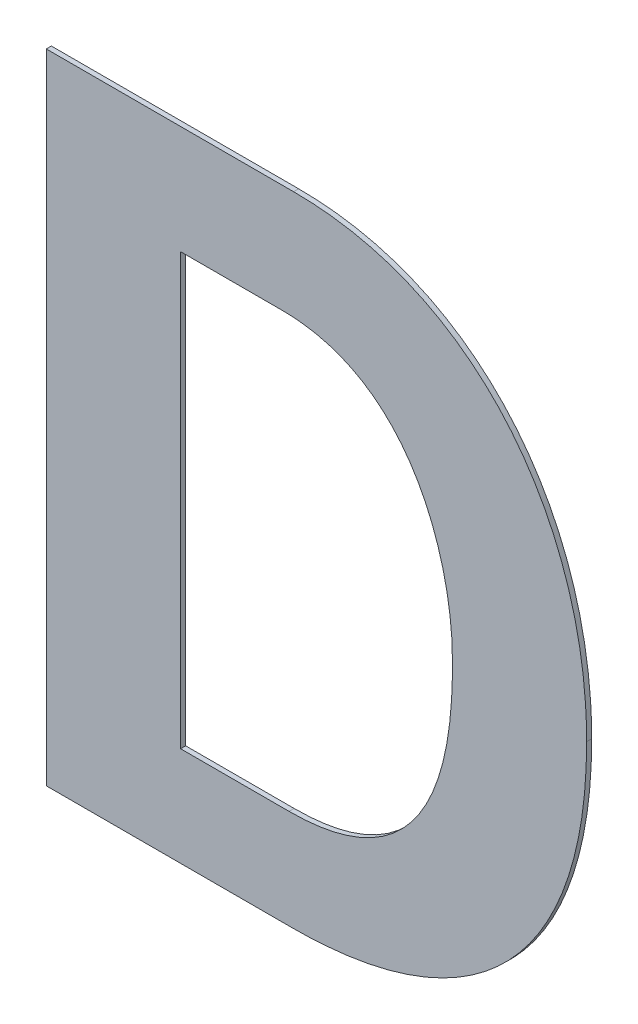
ISO-10303-21;
HEADER;
FILE_DESCRIPTION(('STEP AP214'),'2;1');
FILE_NAME('part.step','',(''),(''),'','','');
FILE_SCHEMA(('AUTOMOTIVE_DESIGN { 1 0 10303 214 1 1 1 1 }'));
ENDSEC;
DATA;
#1=APPLICATION_CONTEXT('core data for automotive mechanical design processes');
#2=APPLICATION_PROTOCOL_DEFINITION('international standard','automotive_design',2000,#1);
#3=PRODUCT_CONTEXT('',#1,'mechanical');
#4=PRODUCT('Part','Part','',(#3));
#5=PRODUCT_RELATED_PRODUCT_CATEGORY('part','',(#4));
#6=PRODUCT_DEFINITION_FORMATION('','',#4);
#7=PRODUCT_DEFINITION_CONTEXT('part definition',#1,'design');
#8=PRODUCT_DEFINITION('design','',#6,#7);
#9=PRODUCT_DEFINITION_SHAPE('','',#8);
#10=(LENGTH_UNIT() NAMED_UNIT(*) SI_UNIT(.MILLI.,.METRE.));
#11=(NAMED_UNIT(*) PLANE_ANGLE_UNIT() SI_UNIT($,.RADIAN.));
#12=(NAMED_UNIT(*) SI_UNIT($,.STERADIAN.) SOLID_ANGLE_UNIT());
#13=UNCERTAINTY_MEASURE_WITH_UNIT(LENGTH_MEASURE(1.E-05),#10,'distance_accuracy_value','');
#14=(GEOMETRIC_REPRESENTATION_CONTEXT(3) GLOBAL_UNCERTAINTY_ASSIGNED_CONTEXT((#13)) GLOBAL_UNIT_ASSIGNED_CONTEXT((#10,
#11,#12)) REPRESENTATION_CONTEXT('',''));
#15=CARTESIAN_POINT('',(0.,0.,0.));
#16=DIRECTION('',(0.,0.,1.));
#17=DIRECTION('',(1.,0.,0.));
#18=AXIS2_PLACEMENT_3D('',#15,#16,#17);
#19=CARTESIAN_POINT('',(-0.8101308747903,-0.1544312260326,0.00086146168299));
#20=DIRECTION('',(0.,-1.,0.));
#21=DIRECTION('',(0.,0.,-1.));
#22=AXIS2_PLACEMENT_3D('',#19,#20,#21);
#23=PLANE('',#22);
#24=DIRECTION('',(0.,0.,1.));
#25=VECTOR('',#24,1.);
#26=CARTESIAN_POINT('',(-0.7809968723185,-0.1544312260326,-0.00033853831701));
#27=LINE('',#26,#25);
#28=CARTESIAN_POINT('',(-0.7809968723185,-0.1544312260326,-0.00033853831701));
#29=VERTEX_POINT('',#28);
#30=CARTESIAN_POINT('',(-0.7809968723185,-0.1544312260326,0.00086146168299));
#31=VERTEX_POINT('',#30);
#32=EDGE_CURVE('E11',#29,#31,#27,.T.);
#33=ORIENTED_EDGE('',*,*,#32,.T.);
#34=DIRECTION('',(-1.,0.,0.));
#35=VECTOR('',#34,1.);
#36=CARTESIAN_POINT('',(-0.7809968723185,-0.1544312260326,0.00086146168299));
#37=LINE('',#36,#35);
#38=CARTESIAN_POINT('',(-0.8392648772621,-0.1544312260326,0.00086146168299));
#39=VERTEX_POINT('',#38);
#40=EDGE_CURVE('E24',#31,#39,#37,.T.);
#41=ORIENTED_EDGE('',*,*,#40,.T.);
#42=DIRECTION('',(0.,0.,1.));
#43=VECTOR('',#42,1.);
#44=CARTESIAN_POINT('',(-0.8392648772621,-0.1544312260326,-0.00033853831701));
#45=LINE('',#44,#43);
#46=CARTESIAN_POINT('',(-0.8392648772621,-0.1544312260326,-0.00033853831701));
#47=VERTEX_POINT('',#46);
#48=EDGE_CURVE('E212',#47,#39,#45,.T.);
#49=ORIENTED_EDGE('',*,*,#48,.F.);
#50=DIRECTION('',(-1.,0.,0.));
#51=VECTOR('',#50,1.);
#52=CARTESIAN_POINT('',(-0.7809968723185,-0.1544312260326,-0.00033853831701));
#53=LINE('',#52,#51);
#54=EDGE_CURVE('E209',#29,#47,#53,.T.);
#55=ORIENTED_EDGE('',*,*,#54,.F.);
#56=EDGE_LOOP('',(#33,#41,#49,#55));
#57=FACE_BOUND('',#56,.T.);
#58=ADVANCED_FACE('F17',(#57),#23,.T.);
#59=CARTESIAN_POINT('',(-0.8392648772621,-0.078781583834882,0.00086146168299));
#60=DIRECTION('',(-1.,0.,0.));
#61=DIRECTION('',(0.,0.,1.));
#62=AXIS2_PLACEMENT_3D('',#59,#60,#61);
#63=PLANE('',#62);
#64=ORIENTED_EDGE('',*,*,#48,.T.);
#65=DIRECTION('',(0.,1.,0.));
#66=VECTOR('',#65,1.);
#67=CARTESIAN_POINT('',(-0.8392648772621,-0.1544312260326,0.00086146168299));
#68=LINE('',#67,#66);
#69=CARTESIAN_POINT('',(-0.8392648772621,-0.00313194163716401,0.00086146168299));
#70=VERTEX_POINT('',#69);
#71=EDGE_CURVE('E207',#39,#70,#68,.T.);
#72=ORIENTED_EDGE('',*,*,#71,.T.);
#73=DIRECTION('',(0.,0.,1.));
#74=VECTOR('',#73,1.);
#75=CARTESIAN_POINT('',(-0.8392648772621,-0.00313194163716401,-0.00033853831701));
#76=LINE('',#75,#74);
#77=CARTESIAN_POINT('',(-0.8392648772621,-0.00313194163716401,-0.00033853831701));
#78=VERTEX_POINT('',#77);
#79=EDGE_CURVE('E204',#78,#70,#76,.T.);
#80=ORIENTED_EDGE('',*,*,#79,.F.);
#81=DIRECTION('',(0.,1.,0.));
#82=VECTOR('',#81,1.);
#83=CARTESIAN_POINT('',(-0.8392648772621,-0.1544312260326,-0.00033853831701));
#84=LINE('',#83,#82);
#85=EDGE_CURVE('E201',#47,#78,#84,.T.);
#86=ORIENTED_EDGE('',*,*,#85,.F.);
#87=EDGE_LOOP('',(#64,#72,#80,#86));
#88=FACE_BOUND('',#87,.T.);
#89=ADVANCED_FACE('F219',(#88),#63,.T.);
#90=CARTESIAN_POINT('',(-0.8099545875059,-0.00313194163716401,0.00086146168299));
#91=DIRECTION('',(0.,1.,0.));
#92=DIRECTION('',(0.,0.,1.));
#93=AXIS2_PLACEMENT_3D('',#90,#91,#92);
#94=PLANE('',#93);
#95=ORIENTED_EDGE('',*,*,#79,.T.);
#96=DIRECTION('',(1.,0.,0.));
#97=VECTOR('',#96,1.);
#98=CARTESIAN_POINT('',(-0.8392648772621,-0.00313194163716401,0.00086146168299));
#99=LINE('',#98,#97);
#100=CARTESIAN_POINT('',(-0.7806442977497,-0.00313194163716401,0.00086146168299));
#101=VERTEX_POINT('',#100);
#102=EDGE_CURVE('E199',#70,#101,#99,.T.);
#103=ORIENTED_EDGE('',*,*,#102,.T.);
#104=DIRECTION('',(0.,0.,1.));
#105=VECTOR('',#104,1.);
#106=CARTESIAN_POINT('',(-0.7806442977497,-0.00313194163716401,-0.00033853831701));
#107=LINE('',#106,#105);
#108=CARTESIAN_POINT('',(-0.7806442977497,-0.00313194163716401,-0.00033853831701));
#109=VERTEX_POINT('',#108);
#110=EDGE_CURVE('E196',#109,#101,#107,.T.);
#111=ORIENTED_EDGE('',*,*,#110,.F.);
#112=DIRECTION('',(1.,0.,0.));
#113=VECTOR('',#112,1.);
#114=CARTESIAN_POINT('',(-0.8392648772621,-0.00313194163716401,-0.00033853831701));
#115=LINE('',#114,#113);
#116=EDGE_CURVE('E190',#78,#109,#115,.T.);
#117=ORIENTED_EDGE('',*,*,#116,.F.);
#118=EDGE_LOOP('',(#95,#103,#111,#117));
#119=FACE_BOUND('',#118,.T.);
#120=ADVANCED_FACE('F225',(#119),#94,.T.);
#121=CARTESIAN_POINT('',(-0.7806442977497,-0.00313194163716401,0.00086146168299));
#122=CARTESIAN_POINT('',(-0.7806442977497,-0.00313194163716401,-0.00057853831701));
#123=CARTESIAN_POINT('',(-0.7372075443469,-0.00313194163716401,0.00086146168299));
#124=CARTESIAN_POINT('',(-0.7372075443469,-0.00313194163716401,-0.00057853831701));
#125=CARTESIAN_POINT('',(-0.7111531506869,-0.0375122970442,0.00086146168299));
#126=CARTESIAN_POINT('',(-0.7111531506869,-0.0375122970442,-0.00057853831701));
#127=CARTESIAN_POINT('',(-0.7111531506869,-0.0813016250162,0.00086146168299));
#128=CARTESIAN_POINT('',(-0.7111531506869,-0.0813016250162,-0.00057853831701));
#129=B_SPLINE_SURFACE_WITH_KNOTS('',3,1,((#121,#122),(#123,#124),(#125,#126),(#127,#128)),
.UNSPECIFIED.,.F.,.F.,.F.,(4,4),(2,2),(0.,1.),(0.,0.00036),.UNSPECIFIED.);
#130=CARTESIAN_POINT('',(-0.7806442977497,-0.00313194163716401,0.00086146168299));
#131=CARTESIAN_POINT('',(-0.7372075443469,-0.00313194163716401,0.00086146168299));
#132=CARTESIAN_POINT('',(-0.7111531506869,-0.0375122970442,0.00086146168299));
#133=CARTESIAN_POINT('',(-0.7111531506869,-0.0813016250162,0.00086146168299));
#134=B_SPLINE_CURVE_WITH_KNOTS('',3,(#130,#131,#132,#133),.UNSPECIFIED.,.F.,.F.,(4,4),(0.,1.),.UNSPECIFIED.);
#135=CARTESIAN_POINT('',(-0.7111531506869,-0.0813016250162,0.00086146168299));
#136=VERTEX_POINT('',#135);
#137=EDGE_CURVE('E186',#101,#136,#134,.T.);
#138=DIRECTION('',(0.,0.,1.));
#139=VECTOR('',#138,1.);
#140=CARTESIAN_POINT('',(-0.7111531506869,-0.0813016250162,-0.00033853831701));
#141=LINE('',#140,#139);
#142=CARTESIAN_POINT('',(-0.7111531506869,-0.0813016250162,-0.00033853831701));
#143=VERTEX_POINT('',#142);
#144=EDGE_CURVE('E180',#143,#136,#141,.T.);
#145=CARTESIAN_POINT('',(-0.7806442977497,-0.00313194163716401,-0.00033853831701));
#146=CARTESIAN_POINT('',(-0.7372075443469,-0.00313194163716401,-0.00033853831701));
#147=CARTESIAN_POINT('',(-0.7111531506869,-0.0375122970442,-0.00033853831701));
#148=CARTESIAN_POINT('',(-0.7111531506869,-0.0813016250162,-0.00033853831701));
#149=B_SPLINE_CURVE_WITH_KNOTS('',3,(#145,#146,#147,#148),.UNSPECIFIED.,.F.,.F.,(4,4),(0.,1.),.UNSPECIFIED.);
#150=EDGE_CURVE('E172',#109,#143,#149,.T.);
#151=ORIENTED_EDGE('',*,*,#110,.T.);
#152=ORIENTED_EDGE('',*,*,#137,.T.);
#153=ORIENTED_EDGE('',*,*,#144,.F.);
#154=ORIENTED_EDGE('',*,*,#150,.F.);
#155=EDGE_LOOP('',(#151,#152,#153,#154));
#156=FACE_BOUND('',#155,.T.);
#157=ADVANCED_FACE('F229',(#156),#129,.T.);
#158=CARTESIAN_POINT('',(-0.7111531506869,-0.0813016250162,0.00086146168299));
#159=CARTESIAN_POINT('',(-0.7111531506869,-0.0813016250162,-0.00057853831701));
#160=CARTESIAN_POINT('',(-0.7111531506869,-0.1251054027658,0.00086146168299));
#161=CARTESIAN_POINT('',(-0.7111531506869,-0.1251054027658,-0.00057853831701));
#162=CARTESIAN_POINT('',(-0.7343060290417,-0.1544312260326,0.00086146168299));
#163=CARTESIAN_POINT('',(-0.7343060290417,-0.1544312260326,-0.00057853831701));
#164=CARTESIAN_POINT('',(-0.7809968723185,-0.1544312260326,0.00086146168299));
#165=CARTESIAN_POINT('',(-0.7809968723185,-0.1544312260326,-0.00057853831701));
#166=B_SPLINE_SURFACE_WITH_KNOTS('',3,1,((#158,#159),(#160,#161),(#162,#163),(#164,#165)),
.UNSPECIFIED.,.F.,.F.,.F.,(4,4),(2,2),(0.,1.),(0.,0.00036),.UNSPECIFIED.);
#167=CARTESIAN_POINT('',(-0.7111531506869,-0.0813016250162,0.00086146168299));
#168=CARTESIAN_POINT('',(-0.7111531506869,-0.1251054027658,0.00086146168299));
#169=CARTESIAN_POINT('',(-0.7343060290417,-0.1544312260326,0.00086146168299));
#170=CARTESIAN_POINT('',(-0.7809968723185,-0.1544312260326,0.00086146168299));
#171=B_SPLINE_CURVE_WITH_KNOTS('',3,(#167,#168,#169,#170),.UNSPECIFIED.,.F.,.F.,(4,4),(0.,1.),.UNSPECIFIED.);
#172=EDGE_CURVE('E165',#136,#31,#171,.T.);
#173=CARTESIAN_POINT('',(-0.7111531506869,-0.0813016250162,-0.00033853831701));
#174=CARTESIAN_POINT('',(-0.7111531506869,-0.1251054027658,-0.00033853831701));
#175=CARTESIAN_POINT('',(-0.7343060290417,-0.1544312260326,-0.00033853831701));
#176=CARTESIAN_POINT('',(-0.7809968723185,-0.1544312260326,-0.00033853831701));
#177=B_SPLINE_CURVE_WITH_KNOTS('',3,(#173,#174,#175,#176),.UNSPECIFIED.,.F.,.F.,(4,4),(0.,1.),.UNSPECIFIED.);
#178=EDGE_CURVE('E160',#143,#29,#177,.T.);
#179=ORIENTED_EDGE('',*,*,#144,.T.);
#180=ORIENTED_EDGE('',*,*,#172,.T.);
#181=ORIENTED_EDGE('',*,*,#32,.F.);
#182=ORIENTED_EDGE('',*,*,#178,.F.);
#183=EDGE_LOOP('',(#179,#180,#181,#182));
#184=FACE_BOUND('',#183,.T.);
#185=ADVANCED_FACE('F231',(#184),#166,.T.);
#186=CARTESIAN_POINT('',(-0.7954766330235,-0.028836650683436,0.00086146168299));
#187=DIRECTION('',(0.,-1.,0.));
#188=DIRECTION('',(0.,0.,-1.));
#189=AXIS2_PLACEMENT_3D('',#186,#187,#188);
#190=PLANE('',#189);
#191=DIRECTION('',(0.,0.,1.));
#192=VECTOR('',#191,1.);
#193=CARTESIAN_POINT('',(-0.7835313632777,-0.028836650683436,-0.00033853831701));
#194=LINE('',#193,#192);
#195=CARTESIAN_POINT('',(-0.7835313632777,-0.028836650683436,-0.00033853831701));
#196=VERTEX_POINT('',#195);
#197=CARTESIAN_POINT('',(-0.7835313632777,-0.028836650683436,0.00086146168299));
#198=VERTEX_POINT('',#197);
#199=EDGE_CURVE('E114',#196,#198,#194,.T.);
#200=ORIENTED_EDGE('',*,*,#199,.T.);
#201=DIRECTION('',(-1.,0.,0.));
#202=VECTOR('',#201,1.);
#203=CARTESIAN_POINT('',(-0.7835313632777,-0.028836650683436,0.00086146168299));
#204=LINE('',#203,#202);
#205=CARTESIAN_POINT('',(-0.8074219027693,-0.028836650683436,0.00086146168299));
#206=VERTEX_POINT('',#205);
#207=EDGE_CURVE('E157',#198,#206,#204,.T.);
#208=ORIENTED_EDGE('',*,*,#207,.T.);
#209=DIRECTION('',(0.,0.,1.));
#210=VECTOR('',#209,1.);
#211=CARTESIAN_POINT('',(-0.8074219027693,-0.028836650683436,-0.00033853831701));
#212=LINE('',#211,#210);
#213=CARTESIAN_POINT('',(-0.8074219027693,-0.028836650683436,-0.00033853831701));
#214=VERTEX_POINT('',#213);
#215=EDGE_CURVE('E154',#214,#206,#212,.T.);
#216=ORIENTED_EDGE('',*,*,#215,.F.);
#217=DIRECTION('',(-1.,0.,0.));
#218=VECTOR('',#217,1.);
#219=CARTESIAN_POINT('',(-0.7835313632777,-0.028836650683436,-0.00033853831701));
#220=LINE('',#219,#218);
#221=EDGE_CURVE('E152',#196,#214,#220,.T.);
#222=ORIENTED_EDGE('',*,*,#221,.F.);
#223=EDGE_LOOP('',(#200,#208,#216,#222));
#224=FACE_BOUND('',#223,.T.);
#225=ADVANCED_FACE('F233',(#224),#190,.T.);
#226=CARTESIAN_POINT('',(-0.8074219027693,-0.079865317141018,0.00086146168299));
#227=DIRECTION('',(1.,0.,0.));
#228=DIRECTION('',(0.,0.,-1.));
#229=AXIS2_PLACEMENT_3D('',#226,#227,#228);
#230=PLANE('',#229);
#231=ORIENTED_EDGE('',*,*,#215,.T.);
#232=DIRECTION('',(0.,-1.,0.));
#233=VECTOR('',#232,1.);
#234=CARTESIAN_POINT('',(-0.8074219027693,-0.028836650683436,0.00086146168299));
#235=LINE('',#234,#233);
#236=CARTESIAN_POINT('',(-0.8074219027693,-0.1308939835986,0.00086146168299));
#237=VERTEX_POINT('',#236);
#238=EDGE_CURVE('E150',#206,#237,#235,.T.);
#239=ORIENTED_EDGE('',*,*,#238,.T.);
#240=DIRECTION('',(0.,0.,1.));
#241=VECTOR('',#240,1.);
#242=CARTESIAN_POINT('',(-0.8074219027693,-0.1308939835986,-0.00033853831701));
#243=LINE('',#242,#241);
#244=CARTESIAN_POINT('',(-0.8074219027693,-0.1308939835986,-0.00033853831701));
#245=VERTEX_POINT('',#244);
#246=EDGE_CURVE('E147',#245,#237,#243,.T.);
#247=ORIENTED_EDGE('',*,*,#246,.F.);
#248=DIRECTION('',(0.,-1.,0.));
#249=VECTOR('',#248,1.);
#250=CARTESIAN_POINT('',(-0.8074219027693,-0.028836650683436,-0.00033853831701));
#251=LINE('',#250,#249);
#252=EDGE_CURVE('E145',#214,#245,#251,.T.);
#253=ORIENTED_EDGE('',*,*,#252,.F.);
#254=EDGE_LOOP('',(#231,#239,#247,#253));
#255=FACE_BOUND('',#254,.T.);
#256=ADVANCED_FACE('F240',(#255),#230,.T.);
#257=CARTESIAN_POINT('',(-0.7945681032683,-0.1308939835986,0.00086146168299));
#258=DIRECTION('',(0.,1.,0.));
#259=DIRECTION('',(0.,0.,1.));
#260=AXIS2_PLACEMENT_3D('',#257,#258,#259);
#261=PLANE('',#260);
#262=ORIENTED_EDGE('',*,*,#246,.T.);
#263=DIRECTION('',(1.,0.,0.));
#264=VECTOR('',#263,1.);
#265=CARTESIAN_POINT('',(-0.8074219027693,-0.1308939835986,0.00086146168299));
#266=LINE('',#265,#264);
#267=CARTESIAN_POINT('',(-0.7817143037673,-0.1308939835986,0.00086146168299));
#268=VERTEX_POINT('',#267);
#269=EDGE_CURVE('E143',#237,#268,#266,.T.);
#270=ORIENTED_EDGE('',*,*,#269,.T.);
#271=DIRECTION('',(0.,0.,1.));
#272=VECTOR('',#271,1.);
#273=CARTESIAN_POINT('',(-0.7817143037673,-0.1308939835986,-0.00033853831701));
#274=LINE('',#273,#272);
#275=CARTESIAN_POINT('',(-0.7817143037673,-0.1308939835986,-0.00033853831701));
#276=VERTEX_POINT('',#275);
#277=EDGE_CURVE('E141',#276,#268,#274,.T.);
#278=ORIENTED_EDGE('',*,*,#277,.F.);
#279=DIRECTION('',(1.,0.,0.));
#280=VECTOR('',#279,1.);
#281=CARTESIAN_POINT('',(-0.8074219027693,-0.1308939835986,-0.00033853831701));
#282=LINE('',#281,#280);
#283=EDGE_CURVE('E110',#245,#276,#282,.T.);
#284=ORIENTED_EDGE('',*,*,#283,.F.);
#285=EDGE_LOOP('',(#262,#270,#278,#284));
#286=FACE_BOUND('',#285,.T.);
#287=ADVANCED_FACE('F291',(#286),#261,.T.);
#288=CARTESIAN_POINT('',(-0.7817143037673,-0.1308939835986,0.00086146168299));
#289=CARTESIAN_POINT('',(-0.7817143037673,-0.1308939835986,-0.00057853831701));
#290=CARTESIAN_POINT('',(-0.7477009727065,-0.1308939835986,0.00086146168299));
#291=CARTESIAN_POINT('',(-0.7477009727065,-0.1308939835986,-0.00057853831701));
#292=CARTESIAN_POINT('',(-0.7426291008333,-0.1019351846782,0.00086146168299));
#293=CARTESIAN_POINT('',(-0.7426291008333,-0.1019351846782,-0.00057853831701));
#294=CARTESIAN_POINT('',(-0.7429961251797,-0.079865317141,0.00086146168299));
#295=CARTESIAN_POINT('',(-0.7429961251797,-0.079865317141,-0.00057853831701));
#296=B_SPLINE_SURFACE_WITH_KNOTS('',3,1,((#288,#289),(#290,#291),(#292,#293),(#294,#295)),
.UNSPECIFIED.,.F.,.F.,.F.,(4,4),(2,2),(0.,1.),(0.,0.00036),.UNSPECIFIED.);
#297=CARTESIAN_POINT('',(-0.7817143037673,-0.1308939835986,0.00086146168299));
#298=CARTESIAN_POINT('',(-0.7477009727065,-0.1308939835986,0.00086146168299));
#299=CARTESIAN_POINT('',(-0.7426291008333,-0.1019351846782,0.00086146168299));
#300=CARTESIAN_POINT('',(-0.7429961251797,-0.079865317141,0.00086146168299));
#301=B_SPLINE_CURVE_WITH_KNOTS('',3,(#297,#298,#299,#300),.UNSPECIFIED.,.F.,.F.,(4,4),(0.,
0.018256001979919),.UNSPECIFIED.);
#302=CARTESIAN_POINT('',(-0.7429961251797,-0.079865317141,0.00086146168299));
#303=VERTEX_POINT('',#302);
#304=EDGE_CURVE('E96',#268,#303,#301,.T.);
#305=DIRECTION('',(0.,0.,1.));
#306=VECTOR('',#305,1.);
#307=CARTESIAN_POINT('',(-0.7429961251797,-0.079865317141,-0.00033853831701));
#308=LINE('',#307,#306);
#309=CARTESIAN_POINT('',(-0.7429961251797,-0.079865317141,-0.00033853831701));
#310=VERTEX_POINT('',#309);
#311=EDGE_CURVE('E90',#310,#303,#308,.T.);
#312=CARTESIAN_POINT('',(-0.7817143037673,-0.1308939835986,-0.000338538317009999));
#313=CARTESIAN_POINT('',(-0.7477009727065,-0.1308939835986,-0.000338538317009999));
#314=CARTESIAN_POINT('',(-0.7426291008333,-0.1019351846782,-0.000338538317009999));
#315=CARTESIAN_POINT('',(-0.7429961251797,-0.079865317141,-0.000338538317009999));
#316=B_SPLINE_CURVE_WITH_KNOTS('',3,(#312,#313,#314,#315),.UNSPECIFIED.,.F.,.F.,(4,4),(0.,
0.0182560019799211),.UNSPECIFIED.);
#317=EDGE_CURVE('E94',#276,#310,#316,.T.);
#318=ORIENTED_EDGE('',*,*,#277,.T.);
#319=ORIENTED_EDGE('',*,*,#304,.T.);
#320=ORIENTED_EDGE('',*,*,#311,.F.);
#321=ORIENTED_EDGE('',*,*,#317,.F.);
#322=EDGE_LOOP('',(#318,#319,#320,#321));
#323=FACE_BOUND('',#322,.T.);
#324=ADVANCED_FACE('F93',(#323),#296,.T.);
#325=CARTESIAN_POINT('',(-0.7429961251797,-0.079865317141,0.00086146168299));
#326=CARTESIAN_POINT('',(-0.7429961251797,-0.079865317141,-0.00057853831701));
#327=CARTESIAN_POINT('',(-0.7429961251797,-0.0624858473534,0.00086146168299));
#328=CARTESIAN_POINT('',(-0.7429961251797,-0.0624858473534,-0.00057853831701));
#329=CARTESIAN_POINT('',(-0.7513213644385,-0.028836650683436,0.00086146168299));
#330=CARTESIAN_POINT('',(-0.7513213644385,-0.028836650683436,-0.00057853831701));
#331=CARTESIAN_POINT('',(-0.7835313632777,-0.028836650683436,0.00086146168299));
#332=CARTESIAN_POINT('',(-0.7835313632777,-0.028836650683436,-0.00057853831701));
#333=B_SPLINE_SURFACE_WITH_KNOTS('',3,1,((#325,#326),(#327,#328),(#329,#330),(#331,#332)),
.UNSPECIFIED.,.F.,.F.,.F.,(4,4),(2,2),(0.,1.),(0.,0.00036),.UNSPECIFIED.);
#334=CARTESIAN_POINT('',(-0.7429961251797,-0.079865317141,0.00086146168299));
#335=CARTESIAN_POINT('',(-0.7429961251797,-0.0624858473534,0.00086146168299));
#336=CARTESIAN_POINT('',(-0.7513213644385,-0.028836650683436,0.00086146168299));
#337=CARTESIAN_POINT('',(-0.7835313632777,-0.028836650683436,0.00086146168299));
#338=B_SPLINE_CURVE_WITH_KNOTS('',3,(#334,#335,#336,#337),.UNSPECIFIED.,.F.,.F.,(4,4),(0.,1.),.UNSPECIFIED.);
#339=EDGE_CURVE('E111',#303,#198,#338,.T.);
#340=CARTESIAN_POINT('',(-0.7429961251797,-0.079865317141,-0.00033853831701));
#341=CARTESIAN_POINT('',(-0.7429961251797,-0.0624858473534,-0.00033853831701));
#342=CARTESIAN_POINT('',(-0.7513213644385,-0.028836650683436,-0.00033853831701));
#343=CARTESIAN_POINT('',(-0.7835313632777,-0.028836650683436,-0.00033853831701));
#344=B_SPLINE_CURVE_WITH_KNOTS('',3,(#340,#341,#342,#343),.UNSPECIFIED.,.F.,.F.,(4,4),(0.,1.),.UNSPECIFIED.);
#345=EDGE_CURVE('E107',#310,#196,#344,.T.);
#346=ORIENTED_EDGE('',*,*,#311,.T.);
#347=ORIENTED_EDGE('',*,*,#339,.T.);
#348=ORIENTED_EDGE('',*,*,#199,.F.);
#349=ORIENTED_EDGE('',*,*,#345,.F.);
#350=EDGE_LOOP('',(#346,#347,#348,#349));
#351=FACE_BOUND('',#350,.T.);
#352=ADVANCED_FACE('F113',(#351),#333,.T.);
#353=CARTESIAN_POINT('',(-0.7752090139745,-0.1544312260326,-0.00033853831701));
#354=DIRECTION('',(0.,0.,1.));
#355=DIRECTION('',(1.,0.,0.));
#356=AXIS2_PLACEMENT_3D('',#353,#354,#355);
#357=PLANE('',#356);
#358=ORIENTED_EDGE('',*,*,#54,.T.);
#359=ORIENTED_EDGE('',*,*,#85,.T.);
#360=ORIENTED_EDGE('',*,*,#116,.T.);
#361=ORIENTED_EDGE('',*,*,#150,.T.);
#362=ORIENTED_EDGE('',*,*,#178,.T.);
#363=EDGE_LOOP('',(#358,#359,#360,#361,#362));
#364=FACE_BOUND('',#363,.T.);
#365=ORIENTED_EDGE('',*,*,#221,.T.);
#366=ORIENTED_EDGE('',*,*,#252,.T.);
#367=ORIENTED_EDGE('',*,*,#283,.T.);
#368=ORIENTED_EDGE('',*,*,#317,.T.);
#369=ORIENTED_EDGE('',*,*,#345,.T.);
#370=EDGE_LOOP('',(#365,#366,#367,#368,#369));
#371=FACE_BOUND('',#370,.T.);
#372=ADVANCED_FACE('F106',(#364,#371),#357,.F.);
#373=CARTESIAN_POINT('',(-0.7752090139745,-0.1544312260326,0.00086146168299));
#374=DIRECTION('',(0.,0.,1.));
#375=DIRECTION('',(1.,0.,0.));
#376=AXIS2_PLACEMENT_3D('',#373,#374,#375);
#377=PLANE('',#376);
#378=ORIENTED_EDGE('',*,*,#40,.F.);
#379=ORIENTED_EDGE('',*,*,#172,.F.);
#380=ORIENTED_EDGE('',*,*,#137,.F.);
#381=ORIENTED_EDGE('',*,*,#102,.F.);
#382=ORIENTED_EDGE('',*,*,#71,.F.);
#383=EDGE_LOOP('',(#378,#379,#380,#381,#382));
#384=FACE_BOUND('',#383,.T.);
#385=ORIENTED_EDGE('',*,*,#207,.F.);
#386=ORIENTED_EDGE('',*,*,#339,.F.);
#387=ORIENTED_EDGE('',*,*,#304,.F.);
#388=ORIENTED_EDGE('',*,*,#269,.F.);
#389=ORIENTED_EDGE('',*,*,#238,.F.);
#390=EDGE_LOOP('',(#385,#386,#387,#388,#389));
#391=FACE_BOUND('',#390,.T.);
#392=ADVANCED_FACE('F221',(#384,#391),#377,.T.);
#393=CLOSED_SHELL('',(#58,#89,#120,#157,#185,#225,#256,#287,#324,#352,#372,#392));
#394=MANIFOLD_SOLID_BREP('B1',#393);
#395=ADVANCED_BREP_SHAPE_REPRESENTATION('',(#18,#394),#14);
#396=SHAPE_DEFINITION_REPRESENTATION(#9,#395);
ENDSEC;
END-ISO-10303-21;
